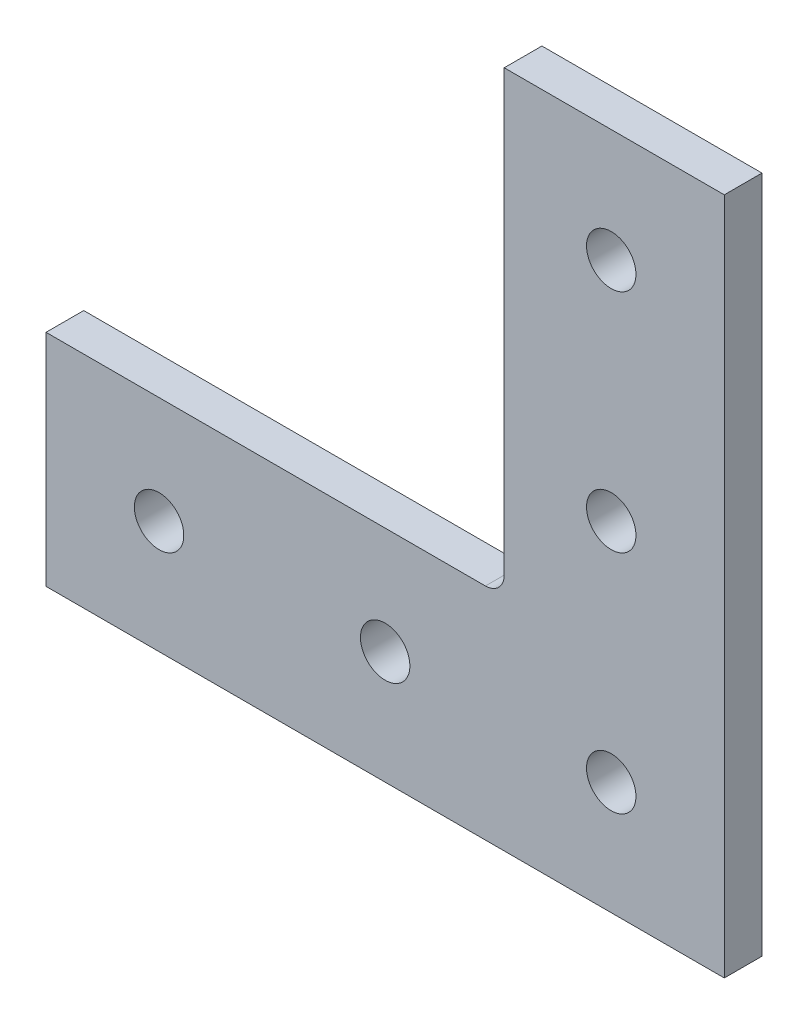
ISO-10303-21;
HEADER;
FILE_DESCRIPTION(('STEP AP214'),'2;1');
FILE_NAME('part.step','',(''),(''),'','','');
FILE_SCHEMA(('AUTOMOTIVE_DESIGN { 1 0 10303 214 1 1 1 1 }'));
ENDSEC;
DATA;
#1=APPLICATION_CONTEXT('core data for automotive mechanical design processes');
#2=APPLICATION_PROTOCOL_DEFINITION('international standard','automotive_design',2000,#1);
#3=PRODUCT_CONTEXT('',#1,'mechanical');
#4=PRODUCT('Part','Part','',(#3));
#5=PRODUCT_RELATED_PRODUCT_CATEGORY('part','',(#4));
#6=PRODUCT_DEFINITION_FORMATION('','',#4);
#7=PRODUCT_DEFINITION_CONTEXT('part definition',#1,'design');
#8=PRODUCT_DEFINITION('design','',#6,#7);
#9=PRODUCT_DEFINITION_SHAPE('','',#8);
#10=(LENGTH_UNIT() NAMED_UNIT(*) SI_UNIT(.MILLI.,.METRE.));
#11=(NAMED_UNIT(*) PLANE_ANGLE_UNIT() SI_UNIT($,.RADIAN.));
#12=(NAMED_UNIT(*) SI_UNIT($,.STERADIAN.) SOLID_ANGLE_UNIT());
#13=UNCERTAINTY_MEASURE_WITH_UNIT(LENGTH_MEASURE(1.E-05),#10,'distance_accuracy_value','');
#14=(GEOMETRIC_REPRESENTATION_CONTEXT(3) GLOBAL_UNCERTAINTY_ASSIGNED_CONTEXT((#13)) GLOBAL_UNIT_ASSIGNED_CONTEXT((#10,
#11,#12)) REPRESENTATION_CONTEXT('',''));
#15=CARTESIAN_POINT('',(0.,0.,0.));
#16=DIRECTION('',(0.,0.,1.));
#17=DIRECTION('',(1.,0.,0.));
#18=AXIS2_PLACEMENT_3D('',#15,#16,#17);
#19=CARTESIAN_POINT('',(-40.259000000001,40.259000000001,0.));
#20=DIRECTION('',(0.,0.,1.));
#21=DIRECTION('',(1.,0.,0.));
#22=AXIS2_PLACEMENT_3D('',#19,#20,#21);
#23=CYLINDRICAL_SURFACE('',#22,3.175000000001);
#24=CARTESIAN_POINT('',(-40.259000000001,40.259000000001,6.35));
#25=DIRECTION('',(0.,0.,-1.));
#26=DIRECTION('',(-1.,0.,0.));
#27=AXIS2_PLACEMENT_3D('',#24,#25,#26);
#28=CIRCLE('',#27,3.175000000001);
#29=CARTESIAN_POINT('',(-37.084,40.259,6.35));
#30=VERTEX_POINT('',#29);
#31=CARTESIAN_POINT('',(-40.259,37.084,6.35));
#32=VERTEX_POINT('',#31);
#33=EDGE_CURVE('E125',#30,#32,#28,.T.);
#34=ORIENTED_EDGE('',*,*,#33,.F.);
#35=DIRECTION('',(0.,0.,1.));
#36=VECTOR('',#35,1.);
#37=CARTESIAN_POINT('',(-37.084,40.259,0.));
#38=LINE('',#37,#36);
#39=CARTESIAN_POINT('',(-37.084,40.259,0.));
#40=VERTEX_POINT('',#39);
#41=EDGE_CURVE('E11',#40,#30,#38,.T.);
#42=ORIENTED_EDGE('',*,*,#41,.F.);
#43=CARTESIAN_POINT('',(-40.259000000001,40.259000000001,0.));
#44=DIRECTION('',(0.,0.,-1.));
#45=DIRECTION('',(-1.,0.,0.));
#46=AXIS2_PLACEMENT_3D('',#43,#44,#45);
#47=CIRCLE('',#46,3.175000000001);
#48=CARTESIAN_POINT('',(-40.259,37.084,0.));
#49=VERTEX_POINT('',#48);
#50=EDGE_CURVE('E143',#40,#49,#47,.T.);
#51=ORIENTED_EDGE('',*,*,#50,.T.);
#52=DIRECTION('',(0.,0.,1.));
#53=VECTOR('',#52,1.);
#54=CARTESIAN_POINT('',(-40.259,37.084,0.));
#55=LINE('',#54,#53);
#56=EDGE_CURVE('E37',#49,#32,#55,.T.);
#57=ORIENTED_EDGE('',*,*,#56,.T.);
#58=EDGE_LOOP('',(#34,#42,#51,#57));
#59=FACE_BOUND('',#58,.T.);
#60=ADVANCED_FACE('F34',(#59),#23,.F.);
#61=CARTESIAN_POINT('',(-37.084,114.3,0.));
#62=DIRECTION('',(-1.,0.,0.));
#63=DIRECTION('',(0.,0.,1.));
#64=AXIS2_PLACEMENT_3D('',#61,#62,#63);
#65=PLANE('',#64);
#66=DIRECTION('',(0.,-1.,0.));
#67=VECTOR('',#66,1.);
#68=CARTESIAN_POINT('',(-37.084,114.3,6.35));
#69=LINE('',#68,#67);
#70=CARTESIAN_POINT('',(-37.084,114.3,6.35));
#71=VERTEX_POINT('',#70);
#72=EDGE_CURVE('E141',#71,#30,#69,.T.);
#73=ORIENTED_EDGE('',*,*,#72,.F.);
#74=DIRECTION('',(0.,0.,1.));
#75=VECTOR('',#74,1.);
#76=CARTESIAN_POINT('',(-37.084,114.3,0.));
#77=LINE('',#76,#75);
#78=CARTESIAN_POINT('',(-37.084,114.3,0.));
#79=VERTEX_POINT('',#78);
#80=EDGE_CURVE('E43',#79,#71,#77,.T.);
#81=ORIENTED_EDGE('',*,*,#80,.F.);
#82=DIRECTION('',(0.,-1.,0.));
#83=VECTOR('',#82,1.);
#84=CARTESIAN_POINT('',(-37.084,114.3,0.));
#85=LINE('',#84,#83);
#86=EDGE_CURVE('E115',#79,#40,#85,.T.);
#87=ORIENTED_EDGE('',*,*,#86,.T.);
#88=ORIENTED_EDGE('',*,*,#41,.T.);
#89=EDGE_LOOP('',(#73,#81,#87,#88));
#90=FACE_BOUND('',#89,.T.);
#91=ADVANCED_FACE('F153',(#90),#65,.T.);
#92=CARTESIAN_POINT('',(0.,114.3,0.));
#93=DIRECTION('',(0.,1.,0.));
#94=DIRECTION('',(0.,0.,1.));
#95=AXIS2_PLACEMENT_3D('',#92,#93,#94);
#96=PLANE('',#95);
#97=DIRECTION('',(-1.,0.,0.));
#98=VECTOR('',#97,1.);
#99=CARTESIAN_POINT('',(0.,114.3,6.35));
#100=LINE('',#99,#98);
#101=CARTESIAN_POINT('',(0.,114.3,6.35));
#102=VERTEX_POINT('',#101);
#103=EDGE_CURVE('E102',#102,#71,#100,.T.);
#104=ORIENTED_EDGE('',*,*,#103,.F.);
#105=DIRECTION('',(0.,0.,1.));
#106=VECTOR('',#105,1.);
#107=CARTESIAN_POINT('',(0.,114.3,0.));
#108=LINE('',#107,#106);
#109=CARTESIAN_POINT('',(0.,114.3,0.));
#110=VERTEX_POINT('',#109);
#111=EDGE_CURVE('E97',#110,#102,#108,.T.);
#112=ORIENTED_EDGE('',*,*,#111,.F.);
#113=DIRECTION('',(-1.,0.,0.));
#114=VECTOR('',#113,1.);
#115=CARTESIAN_POINT('',(0.,114.3,0.));
#116=LINE('',#115,#114);
#117=EDGE_CURVE('E100',#110,#79,#116,.T.);
#118=ORIENTED_EDGE('',*,*,#117,.T.);
#119=ORIENTED_EDGE('',*,*,#80,.T.);
#120=EDGE_LOOP('',(#104,#112,#118,#119));
#121=FACE_BOUND('',#120,.T.);
#122=ADVANCED_FACE('F99',(#121),#96,.T.);
#123=CARTESIAN_POINT('',(0.,0.,0.));
#124=DIRECTION('',(1.,0.,0.));
#125=DIRECTION('',(0.,0.,-1.));
#126=AXIS2_PLACEMENT_3D('',#123,#124,#125);
#127=PLANE('',#126);
#128=DIRECTION('',(0.,1.,0.));
#129=VECTOR('',#128,1.);
#130=CARTESIAN_POINT('',(0.,0.,6.35));
#131=LINE('',#130,#129);
#132=CARTESIAN_POINT('',(0.,0.,6.35));
#133=VERTEX_POINT('',#132);
#134=EDGE_CURVE('E138',#133,#102,#131,.T.);
#135=ORIENTED_EDGE('',*,*,#134,.F.);
#136=DIRECTION('',(0.,0.,1.));
#137=VECTOR('',#136,1.);
#138=CARTESIAN_POINT('',(0.,0.,0.));
#139=LINE('',#138,#137);
#140=CARTESIAN_POINT('',(0.,0.,0.));
#141=VERTEX_POINT('',#140);
#142=EDGE_CURVE('E107',#141,#133,#139,.T.);
#143=ORIENTED_EDGE('',*,*,#142,.F.);
#144=DIRECTION('',(0.,1.,0.));
#145=VECTOR('',#144,1.);
#146=CARTESIAN_POINT('',(0.,0.,0.));
#147=LINE('',#146,#145);
#148=EDGE_CURVE('E113',#141,#110,#147,.T.);
#149=ORIENTED_EDGE('',*,*,#148,.T.);
#150=ORIENTED_EDGE('',*,*,#111,.T.);
#151=EDGE_LOOP('',(#135,#143,#149,#150));
#152=FACE_BOUND('',#151,.T.);
#153=ADVANCED_FACE('F117',(#152),#127,.T.);
#154=CARTESIAN_POINT('',(-114.3,0.,0.));
#155=DIRECTION('',(0.,-1.,0.));
#156=DIRECTION('',(0.,0.,-1.));
#157=AXIS2_PLACEMENT_3D('',#154,#155,#156);
#158=PLANE('',#157);
#159=DIRECTION('',(1.,0.,0.));
#160=VECTOR('',#159,1.);
#161=CARTESIAN_POINT('',(-114.3,0.,6.35));
#162=LINE('',#161,#160);
#163=CARTESIAN_POINT('',(-114.3,0.,6.35));
#164=VERTEX_POINT('',#163);
#165=EDGE_CURVE('E135',#164,#133,#162,.T.);
#166=ORIENTED_EDGE('',*,*,#165,.F.);
#167=DIRECTION('',(0.,0.,1.));
#168=VECTOR('',#167,1.);
#169=CARTESIAN_POINT('',(-114.3,0.,0.));
#170=LINE('',#169,#168);
#171=CARTESIAN_POINT('',(-114.3,0.,0.));
#172=VERTEX_POINT('',#171);
#173=EDGE_CURVE('E147',#172,#164,#170,.T.);
#174=ORIENTED_EDGE('',*,*,#173,.F.);
#175=DIRECTION('',(1.,0.,0.));
#176=VECTOR('',#175,1.);
#177=CARTESIAN_POINT('',(-114.3,0.,0.));
#178=LINE('',#177,#176);
#179=EDGE_CURVE('E118',#172,#141,#178,.T.);
#180=ORIENTED_EDGE('',*,*,#179,.T.);
#181=ORIENTED_EDGE('',*,*,#142,.T.);
#182=EDGE_LOOP('',(#166,#174,#180,#181));
#183=FACE_BOUND('',#182,.T.);
#184=ADVANCED_FACE('F166',(#183),#158,.T.);
#185=CARTESIAN_POINT('',(-114.3,37.084,0.));
#186=DIRECTION('',(-1.,0.,0.));
#187=DIRECTION('',(0.,0.,1.));
#188=AXIS2_PLACEMENT_3D('',#185,#186,#187);
#189=PLANE('',#188);
#190=DIRECTION('',(0.,-1.,0.));
#191=VECTOR('',#190,1.);
#192=CARTESIAN_POINT('',(-114.3,37.084,6.35));
#193=LINE('',#192,#191);
#194=CARTESIAN_POINT('',(-114.3,37.084,6.35));
#195=VERTEX_POINT('',#194);
#196=EDGE_CURVE('E132',#195,#164,#193,.T.);
#197=ORIENTED_EDGE('',*,*,#196,.F.);
#198=DIRECTION('',(0.,0.,1.));
#199=VECTOR('',#198,1.);
#200=CARTESIAN_POINT('',(-114.3,37.084,0.));
#201=LINE('',#200,#199);
#202=CARTESIAN_POINT('',(-114.3,37.084,0.));
#203=VERTEX_POINT('',#202);
#204=EDGE_CURVE('E148',#203,#195,#201,.T.);
#205=ORIENTED_EDGE('',*,*,#204,.F.);
#206=DIRECTION('',(0.,-1.,0.));
#207=VECTOR('',#206,1.);
#208=CARTESIAN_POINT('',(-114.3,37.084,0.));
#209=LINE('',#208,#207);
#210=EDGE_CURVE('E120',#203,#172,#209,.T.);
#211=ORIENTED_EDGE('',*,*,#210,.T.);
#212=ORIENTED_EDGE('',*,*,#173,.T.);
#213=EDGE_LOOP('',(#197,#205,#211,#212));
#214=FACE_BOUND('',#213,.T.);
#215=ADVANCED_FACE('F169',(#214),#189,.T.);
#216=CARTESIAN_POINT('',(-40.259,37.084,0.));
#217=DIRECTION('',(0.,1.,0.));
#218=DIRECTION('',(0.,0.,1.));
#219=AXIS2_PLACEMENT_3D('',#216,#217,#218);
#220=PLANE('',#219);
#221=DIRECTION('',(-1.,0.,0.));
#222=VECTOR('',#221,1.);
#223=CARTESIAN_POINT('',(-40.259,37.084,6.35));
#224=LINE('',#223,#222);
#225=EDGE_CURVE('E128',#32,#195,#224,.T.);
#226=ORIENTED_EDGE('',*,*,#225,.F.);
#227=ORIENTED_EDGE('',*,*,#56,.F.);
#228=DIRECTION('',(-1.,0.,0.));
#229=VECTOR('',#228,1.);
#230=CARTESIAN_POINT('',(-40.259,37.084,0.));
#231=LINE('',#230,#229);
#232=EDGE_CURVE('E239',#49,#203,#231,.T.);
#233=ORIENTED_EDGE('',*,*,#232,.T.);
#234=ORIENTED_EDGE('',*,*,#204,.T.);
#235=EDGE_LOOP('',(#226,#227,#233,#234));
#236=FACE_BOUND('',#235,.T.);
#237=ADVANCED_FACE('F150',(#236),#220,.T.);
#238=CARTESIAN_POINT('',(-40.259000000001,40.259000000001,0.));
#239=DIRECTION('',(0.,0.,-1.));
#240=DIRECTION('',(-1.,0.,0.));
#241=AXIS2_PLACEMENT_3D('',#238,#239,#240);
#242=PLANE('',#241);
#243=CARTESIAN_POINT('',(-19.05,19.05,0.));
#244=DIRECTION('',(0.,0.,1.));
#245=DIRECTION('',(-1.,0.,0.));
#246=AXIS2_PLACEMENT_3D('',#243,#244,#245);
#247=CIRCLE('',#246,4.1656);
#248=CARTESIAN_POINT('',(-23.2156,19.05,0.));
#249=VERTEX_POINT('',#248);
#250=EDGE_CURVE('E208',#249,#249,#247,.T.);
#251=ORIENTED_EDGE('',*,*,#250,.T.);
#252=EDGE_LOOP('',(#251));
#253=FACE_BOUND('',#252,.T.);
#254=CARTESIAN_POINT('',(-19.05,95.25,0.));
#255=DIRECTION('',(0.,0.,1.));
#256=DIRECTION('',(-1.,0.,0.));
#257=AXIS2_PLACEMENT_3D('',#254,#255,#256);
#258=CIRCLE('',#257,4.1656);
#259=CARTESIAN_POINT('',(-23.2156,95.25,0.));
#260=VERTEX_POINT('',#259);
#261=EDGE_CURVE('E216',#260,#260,#258,.T.);
#262=ORIENTED_EDGE('',*,*,#261,.T.);
#263=EDGE_LOOP('',(#262));
#264=FACE_BOUND('',#263,.T.);
#265=CARTESIAN_POINT('',(-19.05,57.15,0.));
#266=DIRECTION('',(0.,0.,1.));
#267=DIRECTION('',(-1.,0.,0.));
#268=AXIS2_PLACEMENT_3D('',#265,#266,#267);
#269=CIRCLE('',#268,4.1656);
#270=CARTESIAN_POINT('',(-23.2156,57.15,0.));
#271=VERTEX_POINT('',#270);
#272=EDGE_CURVE('E222',#271,#271,#269,.T.);
#273=ORIENTED_EDGE('',*,*,#272,.T.);
#274=EDGE_LOOP('',(#273));
#275=FACE_BOUND('',#274,.T.);
#276=CARTESIAN_POINT('',(-57.15,19.05,0.));
#277=DIRECTION('',(0.,0.,1.));
#278=DIRECTION('',(-1.,0.,0.));
#279=AXIS2_PLACEMENT_3D('',#276,#277,#278);
#280=CIRCLE('',#279,4.1656);
#281=CARTESIAN_POINT('',(-61.3156,19.05,0.));
#282=VERTEX_POINT('',#281);
#283=EDGE_CURVE('E228',#282,#282,#280,.T.);
#284=ORIENTED_EDGE('',*,*,#283,.T.);
#285=EDGE_LOOP('',(#284));
#286=FACE_BOUND('',#285,.T.);
#287=CARTESIAN_POINT('',(-95.25,19.05,0.));
#288=DIRECTION('',(0.,0.,1.));
#289=DIRECTION('',(-1.,0.,0.));
#290=AXIS2_PLACEMENT_3D('',#287,#288,#289);
#291=CIRCLE('',#290,4.16560000000001);
#292=CARTESIAN_POINT('',(-99.4156,19.05,0.));
#293=VERTEX_POINT('',#292);
#294=EDGE_CURVE('E129',#293,#293,#291,.T.);
#295=ORIENTED_EDGE('',*,*,#294,.T.);
#296=EDGE_LOOP('',(#295));
#297=FACE_BOUND('',#296,.T.);
#298=ORIENTED_EDGE('',*,*,#50,.F.);
#299=ORIENTED_EDGE('',*,*,#86,.F.);
#300=ORIENTED_EDGE('',*,*,#117,.F.);
#301=ORIENTED_EDGE('',*,*,#148,.F.);
#302=ORIENTED_EDGE('',*,*,#179,.F.);
#303=ORIENTED_EDGE('',*,*,#210,.F.);
#304=ORIENTED_EDGE('',*,*,#232,.F.);
#305=EDGE_LOOP('',(#298,#299,#300,#301,#302,#303,#304));
#306=FACE_BOUND('',#305,.T.);
#307=ADVANCED_FACE('F111',(#253,#264,#275,#286,#297,#306),#242,.T.);
#308=CARTESIAN_POINT('',(-40.259000000001,40.259000000001,6.35));
#309=DIRECTION('',(0.,0.,-1.));
#310=DIRECTION('',(-1.,0.,0.));
#311=AXIS2_PLACEMENT_3D('',#308,#309,#310);
#312=PLANE('',#311);
#313=CARTESIAN_POINT('',(-19.05,19.05,6.35));
#314=DIRECTION('',(0.,0.,1.));
#315=DIRECTION('',(-1.,0.,0.));
#316=AXIS2_PLACEMENT_3D('',#313,#314,#315);
#317=CIRCLE('',#316,4.1656);
#318=CARTESIAN_POINT('',(-23.2156,19.05,6.35));
#319=VERTEX_POINT('',#318);
#320=EDGE_CURVE('E211',#319,#319,#317,.T.);
#321=ORIENTED_EDGE('',*,*,#320,.F.);
#322=EDGE_LOOP('',(#321));
#323=FACE_BOUND('',#322,.T.);
#324=CARTESIAN_POINT('',(-19.05,95.25,6.35));
#325=DIRECTION('',(0.,0.,1.));
#326=DIRECTION('',(-1.,0.,0.));
#327=AXIS2_PLACEMENT_3D('',#324,#325,#326);
#328=CIRCLE('',#327,4.1656);
#329=CARTESIAN_POINT('',(-23.2156,95.25,6.35));
#330=VERTEX_POINT('',#329);
#331=EDGE_CURVE('E213',#330,#330,#328,.T.);
#332=ORIENTED_EDGE('',*,*,#331,.F.);
#333=EDGE_LOOP('',(#332));
#334=FACE_BOUND('',#333,.T.);
#335=CARTESIAN_POINT('',(-19.05,57.15,6.35));
#336=DIRECTION('',(0.,0.,1.));
#337=DIRECTION('',(-1.,0.,0.));
#338=AXIS2_PLACEMENT_3D('',#335,#336,#337);
#339=CIRCLE('',#338,4.1656);
#340=CARTESIAN_POINT('',(-23.2156,57.15,6.35));
#341=VERTEX_POINT('',#340);
#342=EDGE_CURVE('E219',#341,#341,#339,.T.);
#343=ORIENTED_EDGE('',*,*,#342,.F.);
#344=EDGE_LOOP('',(#343));
#345=FACE_BOUND('',#344,.T.);
#346=CARTESIAN_POINT('',(-57.15,19.05,6.35));
#347=DIRECTION('',(0.,0.,1.));
#348=DIRECTION('',(-1.,0.,0.));
#349=AXIS2_PLACEMENT_3D('',#346,#347,#348);
#350=CIRCLE('',#349,4.1656);
#351=CARTESIAN_POINT('',(-61.3156,19.05,6.35));
#352=VERTEX_POINT('',#351);
#353=EDGE_CURVE('E225',#352,#352,#350,.T.);
#354=ORIENTED_EDGE('',*,*,#353,.F.);
#355=EDGE_LOOP('',(#354));
#356=FACE_BOUND('',#355,.T.);
#357=CARTESIAN_POINT('',(-95.25,19.05,6.35));
#358=DIRECTION('',(0.,0.,1.));
#359=DIRECTION('',(-1.,0.,0.));
#360=AXIS2_PLACEMENT_3D('',#357,#358,#359);
#361=CIRCLE('',#360,4.16560000000001);
#362=CARTESIAN_POINT('',(-99.4156,19.05,6.35));
#363=VERTEX_POINT('',#362);
#364=EDGE_CURVE('E231',#363,#363,#361,.T.);
#365=ORIENTED_EDGE('',*,*,#364,.F.);
#366=EDGE_LOOP('',(#365));
#367=FACE_BOUND('',#366,.T.);
#368=ORIENTED_EDGE('',*,*,#33,.T.);
#369=ORIENTED_EDGE('',*,*,#225,.T.);
#370=ORIENTED_EDGE('',*,*,#196,.T.);
#371=ORIENTED_EDGE('',*,*,#165,.T.);
#372=ORIENTED_EDGE('',*,*,#134,.T.);
#373=ORIENTED_EDGE('',*,*,#103,.T.);
#374=ORIENTED_EDGE('',*,*,#72,.T.);
#375=EDGE_LOOP('',(#368,#369,#370,#371,#372,#373,#374));
#376=FACE_BOUND('',#375,.T.);
#377=ADVANCED_FACE('F152',(#323,#334,#345,#356,#367,#376),#312,.F.);
#378=CARTESIAN_POINT('',(-95.25,19.05,0.));
#379=DIRECTION('',(0.,0.,1.));
#380=DIRECTION('',(1.,0.,0.));
#381=AXIS2_PLACEMENT_3D('',#378,#379,#380);
#382=CYLINDRICAL_SURFACE('',#381,4.16560000000001);
#383=ORIENTED_EDGE('',*,*,#294,.F.);
#384=EDGE_LOOP('',(#383));
#385=FACE_BOUND('',#384,.T.);
#386=ORIENTED_EDGE('',*,*,#364,.T.);
#387=EDGE_LOOP('',(#386));
#388=FACE_BOUND('',#387,.T.);
#389=ADVANCED_FACE('F181',(#385,#388),#382,.F.);
#390=CARTESIAN_POINT('',(-57.15,19.05,0.));
#391=DIRECTION('',(0.,0.,1.));
#392=DIRECTION('',(1.,0.,0.));
#393=AXIS2_PLACEMENT_3D('',#390,#391,#392);
#394=CYLINDRICAL_SURFACE('',#393,4.1656);
#395=ORIENTED_EDGE('',*,*,#283,.F.);
#396=EDGE_LOOP('',(#395));
#397=FACE_BOUND('',#396,.T.);
#398=ORIENTED_EDGE('',*,*,#353,.T.);
#399=EDGE_LOOP('',(#398));
#400=FACE_BOUND('',#399,.T.);
#401=ADVANCED_FACE('F188',(#397,#400),#394,.F.);
#402=CARTESIAN_POINT('',(-19.05,57.15,0.));
#403=DIRECTION('',(0.,0.,1.));
#404=DIRECTION('',(1.,0.,0.));
#405=AXIS2_PLACEMENT_3D('',#402,#403,#404);
#406=CYLINDRICAL_SURFACE('',#405,4.1656);
#407=ORIENTED_EDGE('',*,*,#272,.F.);
#408=EDGE_LOOP('',(#407));
#409=FACE_BOUND('',#408,.T.);
#410=ORIENTED_EDGE('',*,*,#342,.T.);
#411=EDGE_LOOP('',(#410));
#412=FACE_BOUND('',#411,.T.);
#413=ADVANCED_FACE('F192',(#409,#412),#406,.F.);
#414=CARTESIAN_POINT('',(-19.05,95.25,0.));
#415=DIRECTION('',(0.,0.,1.));
#416=DIRECTION('',(1.,0.,0.));
#417=AXIS2_PLACEMENT_3D('',#414,#415,#416);
#418=CYLINDRICAL_SURFACE('',#417,4.1656);
#419=ORIENTED_EDGE('',*,*,#261,.F.);
#420=EDGE_LOOP('',(#419));
#421=FACE_BOUND('',#420,.T.);
#422=ORIENTED_EDGE('',*,*,#331,.T.);
#423=EDGE_LOOP('',(#422));
#424=FACE_BOUND('',#423,.T.);
#425=ADVANCED_FACE('F196',(#421,#424),#418,.F.);
#426=CARTESIAN_POINT('',(-19.05,19.05,0.));
#427=DIRECTION('',(0.,0.,1.));
#428=DIRECTION('',(1.,0.,0.));
#429=AXIS2_PLACEMENT_3D('',#426,#427,#428);
#430=CYLINDRICAL_SURFACE('',#429,4.1656);
#431=ORIENTED_EDGE('',*,*,#250,.F.);
#432=EDGE_LOOP('',(#431));
#433=FACE_BOUND('',#432,.T.);
#434=ORIENTED_EDGE('',*,*,#320,.T.);
#435=EDGE_LOOP('',(#434));
#436=FACE_BOUND('',#435,.T.);
#437=ADVANCED_FACE('F200',(#433,#436),#430,.F.);
#438=CLOSED_SHELL('',(#60,#91,#122,#153,#184,#215,#237,#307,#377,#389,#401,#413,#425,#437));
#439=MANIFOLD_SOLID_BREP('B2',#438);
#440=ADVANCED_BREP_SHAPE_REPRESENTATION('',(#18,#439),#14);
#441=SHAPE_DEFINITION_REPRESENTATION(#9,#440);
ENDSEC;
END-ISO-10303-21;
